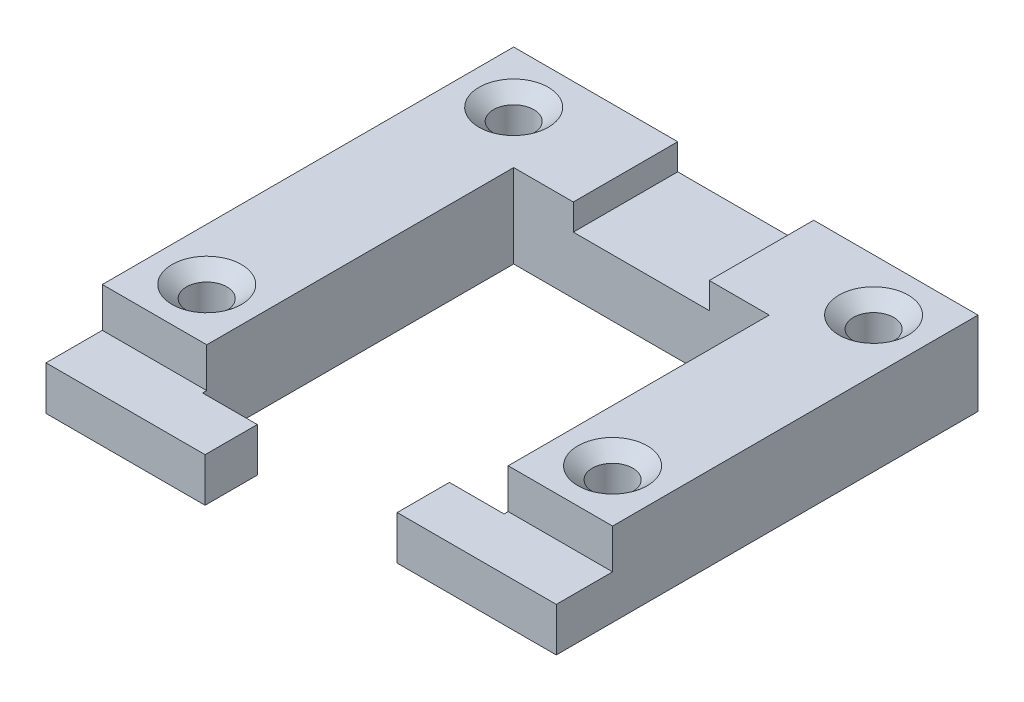
ISO-10303-21;
HEADER;
FILE_DESCRIPTION(('STEP AP214'),'2;1');
FILE_NAME('part.step','',(''),(''),'','','');
FILE_SCHEMA(('AUTOMOTIVE_DESIGN { 1 0 10303 214 1 1 1 1 }'));
ENDSEC;
DATA;
#1=APPLICATION_CONTEXT('core data for automotive mechanical design processes');
#2=APPLICATION_PROTOCOL_DEFINITION('international standard','automotive_design',2000,#1);
#3=PRODUCT_CONTEXT('',#1,'mechanical');
#4=PRODUCT('Part','Part','',(#3));
#5=PRODUCT_RELATED_PRODUCT_CATEGORY('part','',(#4));
#6=PRODUCT_DEFINITION_FORMATION('','',#4);
#7=PRODUCT_DEFINITION_CONTEXT('part definition',#1,'design');
#8=PRODUCT_DEFINITION('design','',#6,#7);
#9=PRODUCT_DEFINITION_SHAPE('','',#8);
#10=(LENGTH_UNIT() NAMED_UNIT(*) SI_UNIT(.MILLI.,.METRE.));
#11=(NAMED_UNIT(*) PLANE_ANGLE_UNIT() SI_UNIT($,.RADIAN.));
#12=(NAMED_UNIT(*) SI_UNIT($,.STERADIAN.) SOLID_ANGLE_UNIT());
#13=UNCERTAINTY_MEASURE_WITH_UNIT(LENGTH_MEASURE(1.E-05),#10,'distance_accuracy_value','');
#14=(GEOMETRIC_REPRESENTATION_CONTEXT(3) GLOBAL_UNCERTAINTY_ASSIGNED_CONTEXT((#13)) GLOBAL_UNIT_ASSIGNED_CONTEXT((#10,
#11,#12)) REPRESENTATION_CONTEXT('',''));
#15=CARTESIAN_POINT('',(0.,0.,0.));
#16=DIRECTION('',(0.,0.,1.));
#17=DIRECTION('',(1.,0.,0.));
#18=AXIS2_PLACEMENT_3D('',#15,#16,#17);
#19=CARTESIAN_POINT('',(28.2399999999999,29.21,-44.45));
#20=DIRECTION('',(0.,0.,1.));
#21=DIRECTION('',(1.,0.,0.));
#22=AXIS2_PLACEMENT_3D('',#19,#20,#21);
#23=PLANE('',#22);
#24=DIRECTION('',(0.,-1.,0.));
#25=VECTOR('',#24,1.);
#26=CARTESIAN_POINT('',(15.5399999999999,29.21,-44.45));
#27=LINE('',#26,#25);
#28=CARTESIAN_POINT('',(15.5399999999999,29.21,-44.45));
#29=VERTEX_POINT('',#28);
#30=CARTESIAN_POINT('',(15.5399999999999,24.384,-44.45));
#31=VERTEX_POINT('',#30);
#32=EDGE_CURVE('E191',#29,#31,#27,.T.);
#33=ORIENTED_EDGE('',*,*,#32,.T.);
#34=DIRECTION('',(-1.,0.,0.));
#35=VECTOR('',#34,1.);
#36=CARTESIAN_POINT('',(0.,24.384,-44.45));
#37=LINE('',#36,#35);
#38=CARTESIAN_POINT('',(28.2399999999999,24.384,-44.45));
#39=VERTEX_POINT('',#38);
#40=EDGE_CURVE('E178',#39,#31,#37,.T.);
#41=ORIENTED_EDGE('',*,*,#40,.F.);
#42=DIRECTION('',(0.,-1.,0.));
#43=VECTOR('',#42,1.);
#44=CARTESIAN_POINT('',(28.2399999999999,29.21,-44.45));
#45=LINE('',#44,#43);
#46=CARTESIAN_POINT('',(28.2399999999999,29.21,-44.45));
#47=VERTEX_POINT('',#46);
#48=EDGE_CURVE('E188',#47,#39,#45,.T.);
#49=ORIENTED_EDGE('',*,*,#48,.F.);
#50=DIRECTION('',(-1.,0.,0.));
#51=VECTOR('',#50,1.);
#52=CARTESIAN_POINT('',(28.2399999999999,29.21,-44.45));
#53=LINE('',#52,#51);
#54=EDGE_CURVE('E236',#47,#29,#53,.T.);
#55=ORIENTED_EDGE('',*,*,#54,.T.);
#56=EDGE_LOOP('',(#33,#41,#49,#55));
#57=FACE_BOUND('',#56,.T.);
#58=ADVANCED_FACE('F37',(#57),#23,.T.);
#59=CARTESIAN_POINT('',(28.2399999999999,29.21,-88.9));
#60=DIRECTION('',(0.,0.,1.));
#61=DIRECTION('',(1.,0.,0.));
#62=AXIS2_PLACEMENT_3D('',#59,#60,#61);
#63=PLANE('',#62);
#64=DIRECTION('',(0.,-1.,0.));
#65=VECTOR('',#64,1.);
#66=CARTESIAN_POINT('',(-8.28500000000023,0.,-88.9));
#67=LINE('',#66,#65);
#68=CARTESIAN_POINT('',(-8.28500000000023,29.21,-88.9));
#69=VERTEX_POINT('',#68);
#70=CARTESIAN_POINT('',(-8.28500000000023,26.035,-88.9));
#71=VERTEX_POINT('',#70);
#72=EDGE_CURVE('E216',#69,#71,#67,.T.);
#73=ORIENTED_EDGE('',*,*,#72,.T.);
#74=DIRECTION('',(-1.,0.,0.));
#75=VECTOR('',#74,1.);
#76=CARTESIAN_POINT('',(0.,26.035,-88.9));
#77=LINE('',#76,#75);
#78=CARTESIAN_POINT('',(8.25499999999979,26.035,-88.9));
#79=VERTEX_POINT('',#78);
#80=EDGE_CURVE('E321',#79,#71,#77,.T.);
#81=ORIENTED_EDGE('',*,*,#80,.F.);
#82=DIRECTION('',(0.,-1.,0.));
#83=VECTOR('',#82,1.);
#84=CARTESIAN_POINT('',(8.25499999999978,0.,-88.9));
#85=LINE('',#84,#83);
#86=CARTESIAN_POINT('',(8.25499999999979,29.21,-88.9));
#87=VERTEX_POINT('',#86);
#88=EDGE_CURVE('E318',#87,#79,#85,.T.);
#89=ORIENTED_EDGE('',*,*,#88,.F.);
#90=DIRECTION('',(-1.,0.,0.));
#91=VECTOR('',#90,1.);
#92=CARTESIAN_POINT('',(28.2399999999999,29.21,-88.9));
#93=LINE('',#92,#91);
#94=CARTESIAN_POINT('',(28.2399999999999,29.21,-88.9));
#95=VERTEX_POINT('',#94);
#96=EDGE_CURVE('E198',#95,#87,#93,.T.);
#97=ORIENTED_EDGE('',*,*,#96,.F.);
#98=DIRECTION('',(0.,-1.,0.));
#99=VECTOR('',#98,1.);
#100=CARTESIAN_POINT('',(28.2399999999999,29.21,-88.9));
#101=LINE('',#100,#99);
#102=CARTESIAN_POINT('',(28.2399999999999,19.05,-88.9));
#103=VERTEX_POINT('',#102);
#104=EDGE_CURVE('E208',#95,#103,#101,.T.);
#105=ORIENTED_EDGE('',*,*,#104,.T.);
#106=DIRECTION('',(-1.,0.,0.));
#107=VECTOR('',#106,1.);
#108=CARTESIAN_POINT('',(28.2399999999999,19.05,-88.9));
#109=LINE('',#108,#107);
#110=CARTESIAN_POINT('',(-28.2400000000001,19.05,-88.9));
#111=VERTEX_POINT('',#110);
#112=EDGE_CURVE('E261',#103,#111,#109,.T.);
#113=ORIENTED_EDGE('',*,*,#112,.T.);
#114=DIRECTION('',(0.,-1.,0.));
#115=VECTOR('',#114,1.);
#116=CARTESIAN_POINT('',(-28.2400000000001,29.21,-88.9));
#117=LINE('',#116,#115);
#118=CARTESIAN_POINT('',(-28.2400000000001,29.21,-88.9));
#119=VERTEX_POINT('',#118);
#120=EDGE_CURVE('E265',#119,#111,#117,.T.);
#121=ORIENTED_EDGE('',*,*,#120,.F.);
#122=EDGE_CURVE('E203',#69,#119,#93,.T.);
#123=ORIENTED_EDGE('',*,*,#122,.F.);
#124=EDGE_LOOP('',(#73,#81,#89,#97,#105,#113,#121,#123));
#125=FACE_BOUND('',#124,.T.);
#126=ADVANCED_FACE('F422',(#125),#63,.F.);
#127=CARTESIAN_POINT('',(15.5399999999999,29.21,-76.2));
#128=DIRECTION('',(0.,0.,1.));
#129=DIRECTION('',(1.,0.,0.));
#130=AXIS2_PLACEMENT_3D('',#127,#128,#129);
#131=PLANE('',#130);
#132=DIRECTION('',(1.,0.,0.));
#133=VECTOR('',#132,1.);
#134=CARTESIAN_POINT('',(15.5399999999999,26.035,-76.2));
#135=LINE('',#134,#133);
#136=CARTESIAN_POINT('',(-8.28500000000023,26.035,-76.2));
#137=VERTEX_POINT('',#136);
#138=CARTESIAN_POINT('',(8.25499999999979,26.035,-76.2));
#139=VERTEX_POINT('',#138);
#140=EDGE_CURVE('E11',#137,#139,#135,.T.);
#141=ORIENTED_EDGE('',*,*,#140,.F.);
#142=DIRECTION('',(0.,1.,0.));
#143=VECTOR('',#142,1.);
#144=CARTESIAN_POINT('',(-8.28500000000022,29.21,-76.2));
#145=LINE('',#144,#143);
#146=CARTESIAN_POINT('',(-8.28500000000023,29.21,-76.2));
#147=VERTEX_POINT('',#146);
#148=EDGE_CURVE('E213',#137,#147,#145,.T.);
#149=ORIENTED_EDGE('',*,*,#148,.T.);
#150=DIRECTION('',(-1.,0.,0.));
#151=VECTOR('',#150,1.);
#152=CARTESIAN_POINT('',(15.5399999999999,29.21,-76.2));
#153=LINE('',#152,#151);
#154=CARTESIAN_POINT('',(-15.5400000000001,29.21,-76.2));
#155=VERTEX_POINT('',#154);
#156=EDGE_CURVE('E223',#147,#155,#153,.T.);
#157=ORIENTED_EDGE('',*,*,#156,.T.);
#158=DIRECTION('',(0.,-1.,0.));
#159=VECTOR('',#158,1.);
#160=CARTESIAN_POINT('',(-15.5400000000001,29.21,-76.2));
#161=LINE('',#160,#159);
#162=CARTESIAN_POINT('',(-15.5400000000001,19.05,-76.2));
#163=VERTEX_POINT('',#162);
#164=EDGE_CURVE('E271',#155,#163,#161,.T.);
#165=ORIENTED_EDGE('',*,*,#164,.T.);
#166=DIRECTION('',(-1.,0.,0.));
#167=VECTOR('',#166,1.);
#168=CARTESIAN_POINT('',(15.5399999999999,19.05,-76.2));
#169=LINE('',#168,#167);
#170=CARTESIAN_POINT('',(15.5399999999999,19.05,-76.2));
#171=VERTEX_POINT('',#170);
#172=EDGE_CURVE('E252',#171,#163,#169,.T.);
#173=ORIENTED_EDGE('',*,*,#172,.F.);
#174=DIRECTION('',(0.,-1.,0.));
#175=VECTOR('',#174,1.);
#176=CARTESIAN_POINT('',(15.5399999999999,29.21,-76.2));
#177=LINE('',#176,#175);
#178=CARTESIAN_POINT('',(15.5399999999999,29.21,-76.2));
#179=VERTEX_POINT('',#178);
#180=EDGE_CURVE('E200',#179,#171,#177,.T.);
#181=ORIENTED_EDGE('',*,*,#180,.F.);
#182=CARTESIAN_POINT('',(8.25499999999979,29.21,-76.2));
#183=VERTEX_POINT('',#182);
#184=EDGE_CURVE('E232',#179,#183,#153,.T.);
#185=ORIENTED_EDGE('',*,*,#184,.T.);
#186=DIRECTION('',(0.,1.,0.));
#187=VECTOR('',#186,1.);
#188=CARTESIAN_POINT('',(8.25499999999979,29.21,-76.2));
#189=LINE('',#188,#187);
#190=EDGE_CURVE('E60',#139,#183,#189,.T.);
#191=ORIENTED_EDGE('',*,*,#190,.F.);
#192=EDGE_LOOP('',(#141,#149,#157,#165,#173,#181,#185,#191));
#193=FACE_BOUND('',#192,.T.);
#194=ADVANCED_FACE('F222',(#193),#131,.T.);
#195=CARTESIAN_POINT('',(0.,29.21,0.));
#196=DIRECTION('',(0.,-1.,0.));
#197=DIRECTION('',(0.,0.,-1.));
#198=AXIS2_PLACEMENT_3D('',#195,#196,#197);
#199=PLANE('',#198);
#200=CARTESIAN_POINT('',(-21.8900000000001,29.21,-82.55));
#201=DIRECTION('',(0.,1.,0.));
#202=DIRECTION('',(0.,0.,1.));
#203=AXIS2_PLACEMENT_3D('',#200,#201,#202);
#204=CIRCLE('',#203,4.2164);
#205=CARTESIAN_POINT('',(-21.8900000000001,29.21,-78.3336));
#206=VERTEX_POINT('',#205);
#207=EDGE_CURVE('E225',#206,#206,#204,.T.);
#208=ORIENTED_EDGE('',*,*,#207,.F.);
#209=EDGE_LOOP('',(#208));
#210=FACE_BOUND('',#209,.T.);
#211=CARTESIAN_POINT('',(-21.8900000000001,29.21,-45.212));
#212=DIRECTION('',(0.,1.,0.));
#213=DIRECTION('',(0.,0.,1.));
#214=AXIS2_PLACEMENT_3D('',#211,#212,#213);
#215=CIRCLE('',#214,4.2164);
#216=CARTESIAN_POINT('',(-21.8900000000001,29.21,-40.9956));
#217=VERTEX_POINT('',#216);
#218=EDGE_CURVE('E346',#217,#217,#215,.T.);
#219=ORIENTED_EDGE('',*,*,#218,.F.);
#220=EDGE_LOOP('',(#219));
#221=FACE_BOUND('',#220,.T.);
#222=DIRECTION('',(0.,0.,1.));
#223=VECTOR('',#222,1.);
#224=CARTESIAN_POINT('',(-8.28500000000023,29.21,0.));
#225=LINE('',#224,#223);
#226=EDGE_CURVE('E45',#69,#147,#225,.T.);
#227=ORIENTED_EDGE('',*,*,#226,.F.);
#228=ORIENTED_EDGE('',*,*,#122,.T.);
#229=DIRECTION('',(0.,0.,-1.));
#230=VECTOR('',#229,1.);
#231=CARTESIAN_POINT('',(-28.2400000000001,29.21,-38.862));
#232=LINE('',#231,#230);
#233=CARTESIAN_POINT('',(-28.2400000000001,29.21,-38.862));
#234=VERTEX_POINT('',#233);
#235=EDGE_CURVE('E244',#234,#119,#232,.T.);
#236=ORIENTED_EDGE('',*,*,#235,.F.);
#237=DIRECTION('',(-1.,0.,0.));
#238=VECTOR('',#237,1.);
#239=CARTESIAN_POINT('',(-15.5400000000001,29.21,-38.862));
#240=LINE('',#239,#238);
#241=CARTESIAN_POINT('',(-15.5400000000001,29.21,-38.862));
#242=VERTEX_POINT('',#241);
#243=EDGE_CURVE('E241',#242,#234,#240,.T.);
#244=ORIENTED_EDGE('',*,*,#243,.F.);
#245=DIRECTION('',(0.,0.,-1.));
#246=VECTOR('',#245,1.);
#247=CARTESIAN_POINT('',(-15.5400000000001,29.21,-38.862));
#248=LINE('',#247,#246);
#249=EDGE_CURVE('E230',#242,#155,#248,.T.);
#250=ORIENTED_EDGE('',*,*,#249,.T.);
#251=ORIENTED_EDGE('',*,*,#156,.F.);
#252=EDGE_LOOP('',(#227,#228,#236,#244,#250,#251));
#253=FACE_BOUND('',#252,.T.);
#254=ADVANCED_FACE('F227',(#210,#221,#253),#199,.F.);
#255=CARTESIAN_POINT('',(28.2399999999999,29.21,-88.9));
#256=DIRECTION('',(1.,0.,0.));
#257=DIRECTION('',(0.,0.,-1.));
#258=AXIS2_PLACEMENT_3D('',#255,#256,#257);
#259=PLANE('',#258);
#260=DIRECTION('',(0.,0.,1.));
#261=VECTOR('',#260,1.);
#262=CARTESIAN_POINT('',(28.2399999999999,19.05,-88.9));
#263=LINE('',#262,#261);
#264=CARTESIAN_POINT('',(28.2399999999999,19.05,-37.6));
#265=VERTEX_POINT('',#264);
#266=EDGE_CURVE('E247',#103,#265,#263,.T.);
#267=ORIENTED_EDGE('',*,*,#266,.F.);
#268=ORIENTED_EDGE('',*,*,#104,.F.);
#269=DIRECTION('',(0.,0.,1.));
#270=VECTOR('',#269,1.);
#271=CARTESIAN_POINT('',(28.2399999999999,29.21,-88.9));
#272=LINE('',#271,#270);
#273=EDGE_CURVE('E197',#95,#47,#272,.T.);
#274=ORIENTED_EDGE('',*,*,#273,.T.);
#275=ORIENTED_EDGE('',*,*,#48,.T.);
#276=DIRECTION('',(0.,0.,1.));
#277=VECTOR('',#276,1.);
#278=CARTESIAN_POINT('',(28.2399999999999,24.384,0.));
#279=LINE('',#278,#277);
#280=CARTESIAN_POINT('',(28.2399999999999,24.384,-37.6));
#281=VERTEX_POINT('',#280);
#282=EDGE_CURVE('E175',#39,#281,#279,.T.);
#283=ORIENTED_EDGE('',*,*,#282,.T.);
#284=DIRECTION('',(0.,-1.,0.));
#285=VECTOR('',#284,1.);
#286=CARTESIAN_POINT('',(28.2399999999999,24.384,-37.6));
#287=LINE('',#286,#285);
#288=EDGE_CURVE('E367',#281,#265,#287,.T.);
#289=ORIENTED_EDGE('',*,*,#288,.T.);
#290=EDGE_LOOP('',(#267,#268,#274,#275,#283,#289));
#291=FACE_BOUND('',#290,.T.);
#292=ADVANCED_FACE('F39',(#291),#259,.T.);
#293=CARTESIAN_POINT('',(-28.2400000000001,29.21,-38.862));
#294=DIRECTION('',(-1.,0.,0.));
#295=DIRECTION('',(0.,0.,1.));
#296=AXIS2_PLACEMENT_3D('',#293,#294,#295);
#297=PLANE('',#296);
#298=DIRECTION('',(0.,0.,-1.));
#299=VECTOR('',#298,1.);
#300=CARTESIAN_POINT('',(-28.2400000000001,19.05,-38.862));
#301=LINE('',#300,#299);
#302=CARTESIAN_POINT('',(-28.2400000000001,19.05,-32.012));
#303=VERTEX_POINT('',#302);
#304=EDGE_CURVE('E258',#303,#111,#301,.T.);
#305=ORIENTED_EDGE('',*,*,#304,.F.);
#306=DIRECTION('',(0.,-1.,0.));
#307=VECTOR('',#306,1.);
#308=CARTESIAN_POINT('',(-28.2400000000001,24.384,-32.012));
#309=LINE('',#308,#307);
#310=CARTESIAN_POINT('',(-28.2400000000001,24.384,-32.012));
#311=VERTEX_POINT('',#310);
#312=EDGE_CURVE('E309',#311,#303,#309,.T.);
#313=ORIENTED_EDGE('',*,*,#312,.F.);
#314=DIRECTION('',(0.,0.,1.));
#315=VECTOR('',#314,1.);
#316=CARTESIAN_POINT('',(-28.2400000000001,24.384,0.));
#317=LINE('',#316,#315);
#318=CARTESIAN_POINT('',(-28.2400000000001,24.384,-38.862));
#319=VERTEX_POINT('',#318);
#320=EDGE_CURVE('E304',#319,#311,#317,.T.);
#321=ORIENTED_EDGE('',*,*,#320,.F.);
#322=DIRECTION('',(0.,-1.,0.));
#323=VECTOR('',#322,1.);
#324=CARTESIAN_POINT('',(-28.2400000000001,29.21,-38.862));
#325=LINE('',#324,#323);
#326=EDGE_CURVE('E267',#234,#319,#325,.T.);
#327=ORIENTED_EDGE('',*,*,#326,.F.);
#328=ORIENTED_EDGE('',*,*,#235,.T.);
#329=ORIENTED_EDGE('',*,*,#120,.T.);
#330=EDGE_LOOP('',(#305,#313,#321,#327,#328,#329));
#331=FACE_BOUND('',#330,.T.);
#332=ADVANCED_FACE('F404',(#331),#297,.T.);
#333=CARTESIAN_POINT('',(-15.5400000000001,29.21,-38.862));
#334=DIRECTION('',(0.,0.,1.));
#335=DIRECTION('',(1.,0.,0.));
#336=AXIS2_PLACEMENT_3D('',#333,#334,#335);
#337=PLANE('',#336);
#338=DIRECTION('',(-1.,0.,0.));
#339=VECTOR('',#338,1.);
#340=CARTESIAN_POINT('',(0.,24.384,-38.862));
#341=LINE('',#340,#339);
#342=CARTESIAN_POINT('',(-15.5400000000001,24.384,-38.862));
#343=VERTEX_POINT('',#342);
#344=EDGE_CURVE('E52',#343,#319,#341,.T.);
#345=ORIENTED_EDGE('',*,*,#344,.F.);
#346=DIRECTION('',(0.,-1.,0.));
#347=VECTOR('',#346,1.);
#348=CARTESIAN_POINT('',(-15.5400000000001,29.21,-38.862));
#349=LINE('',#348,#347);
#350=EDGE_CURVE('E269',#242,#343,#349,.T.);
#351=ORIENTED_EDGE('',*,*,#350,.F.);
#352=ORIENTED_EDGE('',*,*,#243,.T.);
#353=ORIENTED_EDGE('',*,*,#326,.T.);
#354=EDGE_LOOP('',(#345,#351,#352,#353));
#355=FACE_BOUND('',#354,.T.);
#356=ADVANCED_FACE('F435',(#355),#337,.T.);
#357=CARTESIAN_POINT('',(-15.5400000000001,29.21,-38.862));
#358=DIRECTION('',(-1.,0.,0.));
#359=DIRECTION('',(0.,0.,1.));
#360=AXIS2_PLACEMENT_3D('',#357,#358,#359);
#361=PLANE('',#360);
#362=DIRECTION('',(0.,0.,-1.));
#363=VECTOR('',#362,1.);
#364=CARTESIAN_POINT('',(-15.5400000000001,19.05,-38.862));
#365=LINE('',#364,#363);
#366=CARTESIAN_POINT('',(-15.5400000000001,19.05,-38.362));
#367=VERTEX_POINT('',#366);
#368=EDGE_CURVE('E255',#367,#163,#365,.T.);
#369=ORIENTED_EDGE('',*,*,#368,.T.);
#370=ORIENTED_EDGE('',*,*,#164,.F.);
#371=ORIENTED_EDGE('',*,*,#249,.F.);
#372=ORIENTED_EDGE('',*,*,#350,.T.);
#373=DIRECTION('',(0.,0.,1.));
#374=VECTOR('',#373,1.);
#375=CARTESIAN_POINT('',(-15.5400000000001,24.384,0.));
#376=LINE('',#375,#374);
#377=CARTESIAN_POINT('',(-15.5400000000001,24.384,-38.362));
#378=VERTEX_POINT('',#377);
#379=EDGE_CURVE('E387',#343,#378,#376,.T.);
#380=ORIENTED_EDGE('',*,*,#379,.T.);
#381=DIRECTION('',(0.,-1.,0.));
#382=VECTOR('',#381,1.);
#383=CARTESIAN_POINT('',(-15.5400000000001,24.384,-38.362));
#384=LINE('',#383,#382);
#385=EDGE_CURVE('E288',#378,#367,#384,.T.);
#386=ORIENTED_EDGE('',*,*,#385,.T.);
#387=EDGE_LOOP('',(#369,#370,#371,#372,#380,#386));
#388=FACE_BOUND('',#387,.T.);
#389=ADVANCED_FACE('F286',(#388),#361,.F.);
#390=CARTESIAN_POINT('',(15.5399999999999,29.21,-76.2));
#391=DIRECTION('',(1.,0.,0.));
#392=DIRECTION('',(0.,0.,-1.));
#393=AXIS2_PLACEMENT_3D('',#390,#391,#392);
#394=PLANE('',#393);
#395=DIRECTION('',(0.,0.,1.));
#396=VECTOR('',#395,1.);
#397=CARTESIAN_POINT('',(15.5399999999999,19.05,-76.2));
#398=LINE('',#397,#396);
#399=CARTESIAN_POINT('',(15.5399999999999,19.05,-43.95));
#400=VERTEX_POINT('',#399);
#401=EDGE_CURVE('E249',#171,#400,#398,.T.);
#402=ORIENTED_EDGE('',*,*,#401,.T.);
#403=DIRECTION('',(0.,-1.,0.));
#404=VECTOR('',#403,1.);
#405=CARTESIAN_POINT('',(15.5399999999999,24.384,-43.95));
#406=LINE('',#405,#404);
#407=CARTESIAN_POINT('',(15.5399999999999,24.384,-43.95));
#408=VERTEX_POINT('',#407);
#409=EDGE_CURVE('E297',#408,#400,#406,.T.);
#410=ORIENTED_EDGE('',*,*,#409,.F.);
#411=DIRECTION('',(0.,0.,1.));
#412=VECTOR('',#411,1.);
#413=CARTESIAN_POINT('',(15.5399999999999,24.384,0.));
#414=LINE('',#413,#412);
#415=EDGE_CURVE('E365',#31,#408,#414,.T.);
#416=ORIENTED_EDGE('',*,*,#415,.F.);
#417=ORIENTED_EDGE('',*,*,#32,.F.);
#418=DIRECTION('',(0.,0.,1.));
#419=VECTOR('',#418,1.);
#420=CARTESIAN_POINT('',(15.5399999999999,29.21,-76.2));
#421=LINE('',#420,#419);
#422=EDGE_CURVE('E233',#179,#29,#421,.T.);
#423=ORIENTED_EDGE('',*,*,#422,.F.);
#424=ORIENTED_EDGE('',*,*,#180,.T.);
#425=EDGE_LOOP('',(#402,#410,#416,#417,#423,#424));
#426=FACE_BOUND('',#425,.T.);
#427=ADVANCED_FACE('F275',(#426),#394,.F.);
#428=CARTESIAN_POINT('',(21.8899999999999,29.21,-82.55));
#429=DIRECTION('',(0.,1.,0.));
#430=DIRECTION('',(0.,0.,1.));
#431=AXIS2_PLACEMENT_3D('',#428,#429,#430);
#432=CIRCLE('',#431,4.2164);
#433=CARTESIAN_POINT('',(21.8899999999999,29.21,-78.3336));
#434=VERTEX_POINT('',#433);
#435=EDGE_CURVE('E337',#434,#434,#432,.T.);
#436=ORIENTED_EDGE('',*,*,#435,.F.);
#437=EDGE_LOOP('',(#436));
#438=FACE_BOUND('',#437,.T.);
#439=CARTESIAN_POINT('',(21.8899999999999,29.21,-50.8));
#440=DIRECTION('',(0.,1.,0.));
#441=DIRECTION('',(0.,0.,1.));
#442=AXIS2_PLACEMENT_3D('',#439,#440,#441);
#443=CIRCLE('',#442,4.2164);
#444=CARTESIAN_POINT('',(21.8899999999999,29.21,-46.5836));
#445=VERTEX_POINT('',#444);
#446=EDGE_CURVE('E355',#445,#445,#443,.T.);
#447=ORIENTED_EDGE('',*,*,#446,.F.);
#448=EDGE_LOOP('',(#447));
#449=FACE_BOUND('',#448,.T.);
#450=ORIENTED_EDGE('',*,*,#96,.T.);
#451=DIRECTION('',(0.,0.,1.));
#452=VECTOR('',#451,1.);
#453=CARTESIAN_POINT('',(8.25499999999979,29.21,0.));
#454=LINE('',#453,#452);
#455=EDGE_CURVE('E207',#87,#183,#454,.T.);
#456=ORIENTED_EDGE('',*,*,#455,.T.);
#457=ORIENTED_EDGE('',*,*,#184,.F.);
#458=ORIENTED_EDGE('',*,*,#422,.T.);
#459=ORIENTED_EDGE('',*,*,#54,.F.);
#460=ORIENTED_EDGE('',*,*,#273,.F.);
#461=EDGE_LOOP('',(#450,#456,#457,#458,#459,#460));
#462=FACE_BOUND('',#461,.T.);
#463=ADVANCED_FACE('F364',(#438,#449,#462),#199,.F.);
#464=CARTESIAN_POINT('',(0.,19.05,0.));
#465=DIRECTION('',(0.,-1.,0.));
#466=DIRECTION('',(0.,0.,-1.));
#467=AXIS2_PLACEMENT_3D('',#464,#465,#466);
#468=PLANE('',#467);
#469=CARTESIAN_POINT('',(-21.8900000000001,19.05,-82.55));
#470=DIRECTION('',(0.,1.,0.));
#471=DIRECTION('',(0.,0.,1.));
#472=AXIS2_PLACEMENT_3D('',#469,#470,#471);
#473=CIRCLE('',#472,2.45745);
#474=CARTESIAN_POINT('',(-21.8900000000001,19.05,-80.09255));
#475=VERTEX_POINT('',#474);
#476=EDGE_CURVE('E334',#475,#475,#473,.T.);
#477=ORIENTED_EDGE('',*,*,#476,.T.);
#478=EDGE_LOOP('',(#477));
#479=FACE_BOUND('',#478,.T.);
#480=CARTESIAN_POINT('',(21.8899999999999,19.05,-82.55));
#481=DIRECTION('',(0.,1.,0.));
#482=DIRECTION('',(0.,0.,1.));
#483=AXIS2_PLACEMENT_3D('',#480,#481,#482);
#484=CIRCLE('',#483,2.45745);
#485=CARTESIAN_POINT('',(21.8899999999999,19.05,-80.09255));
#486=VERTEX_POINT('',#485);
#487=EDGE_CURVE('E343',#486,#486,#484,.T.);
#488=ORIENTED_EDGE('',*,*,#487,.T.);
#489=EDGE_LOOP('',(#488));
#490=FACE_BOUND('',#489,.T.);
#491=CARTESIAN_POINT('',(-21.8900000000001,19.05,-45.212));
#492=DIRECTION('',(0.,1.,0.));
#493=DIRECTION('',(0.,0.,1.));
#494=AXIS2_PLACEMENT_3D('',#491,#492,#493);
#495=CIRCLE('',#494,2.45745);
#496=CARTESIAN_POINT('',(-21.8900000000001,19.05,-42.75455));
#497=VERTEX_POINT('',#496);
#498=EDGE_CURVE('E352',#497,#497,#495,.T.);
#499=ORIENTED_EDGE('',*,*,#498,.T.);
#500=EDGE_LOOP('',(#499));
#501=FACE_BOUND('',#500,.T.);
#502=CARTESIAN_POINT('',(21.8899999999999,19.05,-50.8));
#503=DIRECTION('',(0.,1.,0.));
#504=DIRECTION('',(0.,0.,1.));
#505=AXIS2_PLACEMENT_3D('',#502,#503,#504);
#506=CIRCLE('',#505,2.45745);
#507=CARTESIAN_POINT('',(21.8899999999999,19.05,-48.34255));
#508=VERTEX_POINT('',#507);
#509=EDGE_CURVE('E250',#508,#508,#506,.T.);
#510=ORIENTED_EDGE('',*,*,#509,.T.);
#511=EDGE_LOOP('',(#510));
#512=FACE_BOUND('',#511,.T.);
#513=ORIENTED_EDGE('',*,*,#266,.T.);
#514=DIRECTION('',(-1.,0.,0.));
#515=VECTOR('',#514,1.);
#516=CARTESIAN_POINT('',(0.,19.05,-37.6));
#517=LINE('',#516,#515);
#518=CARTESIAN_POINT('',(8.88999999999985,19.05,-37.6));
#519=VERTEX_POINT('',#518);
#520=EDGE_CURVE('E376',#265,#519,#517,.T.);
#521=ORIENTED_EDGE('',*,*,#520,.T.);
#522=DIRECTION('',(0.,0.,1.));
#523=VECTOR('',#522,1.);
#524=CARTESIAN_POINT('',(8.88999999999985,19.05,0.));
#525=LINE('',#524,#523);
#526=CARTESIAN_POINT('',(8.88999999999985,19.05,-43.95));
#527=VERTEX_POINT('',#526);
#528=EDGE_CURVE('E379',#527,#519,#525,.T.);
#529=ORIENTED_EDGE('',*,*,#528,.F.);
#530=DIRECTION('',(-1.,0.,0.));
#531=VECTOR('',#530,1.);
#532=CARTESIAN_POINT('',(0.,19.05,-43.95));
#533=LINE('',#532,#531);
#534=EDGE_CURVE('E192',#400,#527,#533,.T.);
#535=ORIENTED_EDGE('',*,*,#534,.F.);
#536=ORIENTED_EDGE('',*,*,#401,.F.);
#537=ORIENTED_EDGE('',*,*,#172,.T.);
#538=ORIENTED_EDGE('',*,*,#368,.F.);
#539=DIRECTION('',(1.,0.,0.));
#540=VECTOR('',#539,1.);
#541=CARTESIAN_POINT('',(0.,19.05,-38.362));
#542=LINE('',#541,#540);
#543=CARTESIAN_POINT('',(-8.89000000000014,19.05,-38.362));
#544=VERTEX_POINT('',#543);
#545=EDGE_CURVE('E292',#367,#544,#542,.T.);
#546=ORIENTED_EDGE('',*,*,#545,.T.);
#547=DIRECTION('',(0.,0.,1.));
#548=VECTOR('',#547,1.);
#549=CARTESIAN_POINT('',(-8.89000000000014,19.05,0.));
#550=LINE('',#549,#548);
#551=CARTESIAN_POINT('',(-8.89000000000014,19.05,-32.012));
#552=VERTEX_POINT('',#551);
#553=EDGE_CURVE('E295',#544,#552,#550,.T.);
#554=ORIENTED_EDGE('',*,*,#553,.T.);
#555=DIRECTION('',(1.,0.,0.));
#556=VECTOR('',#555,1.);
#557=CARTESIAN_POINT('',(0.,19.05,-32.012));
#558=LINE('',#557,#556);
#559=EDGE_CURVE('E299',#303,#552,#558,.T.);
#560=ORIENTED_EDGE('',*,*,#559,.F.);
#561=ORIENTED_EDGE('',*,*,#304,.T.);
#562=ORIENTED_EDGE('',*,*,#112,.F.);
#563=EDGE_LOOP('',(#513,#521,#529,#535,#536,#537,#538,#546,#554,#560,#561,#562));
#564=FACE_BOUND('',#563,.T.);
#565=ADVANCED_FACE('F282',(#479,#490,#501,#512,#564),#468,.T.);
#566=CARTESIAN_POINT('',(21.8899999999999,29.21,-50.8));
#567=DIRECTION('',(0.,1.,0.));
#568=DIRECTION('',(0.,0.,1.));
#569=AXIS2_PLACEMENT_3D('',#566,#567,#568);
#570=CYLINDRICAL_SURFACE('',#569,2.45744999999999);
#571=ORIENTED_EDGE('',*,*,#509,.F.);
#572=EDGE_LOOP('',(#571));
#573=FACE_BOUND('',#572,.T.);
#574=CARTESIAN_POINT('',(21.8899999999999,27.7340657037407,-50.8));
#575=DIRECTION('',(0.,1.,0.));
#576=DIRECTION('',(0.,0.,1.));
#577=AXIS2_PLACEMENT_3D('',#574,#575,#576);
#578=CIRCLE('',#577,2.45744999999999);
#579=CARTESIAN_POINT('',(21.8899999999999,27.7340657037407,-48.34255));
#580=VERTEX_POINT('',#579);
#581=EDGE_CURVE('E358',#580,#580,#578,.T.);
#582=ORIENTED_EDGE('',*,*,#581,.T.);
#583=EDGE_LOOP('',(#582));
#584=FACE_BOUND('',#583,.T.);
#585=ADVANCED_FACE('F442',(#573,#584),#570,.F.);
#586=CARTESIAN_POINT('',(21.8899999999999,29.21,-50.8));
#587=DIRECTION('',(0.,1.,0.));
#588=DIRECTION('',(0.,0.,1.));
#589=AXIS2_PLACEMENT_3D('',#586,#587,#588);
#590=CONICAL_SURFACE('',#589,4.2164,0.872664625997163);
#591=ORIENTED_EDGE('',*,*,#581,.F.);
#592=EDGE_LOOP('',(#591));
#593=FACE_BOUND('',#592,.T.);
#594=ORIENTED_EDGE('',*,*,#446,.T.);
#595=EDGE_LOOP('',(#594));
#596=FACE_BOUND('',#595,.T.);
#597=ADVANCED_FACE('F449',(#593,#596),#590,.F.);
#598=CARTESIAN_POINT('',(-21.8900000000001,29.21,-45.212));
#599=DIRECTION('',(0.,1.,0.));
#600=DIRECTION('',(0.,0.,1.));
#601=AXIS2_PLACEMENT_3D('',#598,#599,#600);
#602=CYLINDRICAL_SURFACE('',#601,2.45744999999999);
#603=ORIENTED_EDGE('',*,*,#498,.F.);
#604=EDGE_LOOP('',(#603));
#605=FACE_BOUND('',#604,.T.);
#606=CARTESIAN_POINT('',(-21.8900000000001,27.7340657037407,-45.212));
#607=DIRECTION('',(0.,1.,0.));
#608=DIRECTION('',(0.,0.,1.));
#609=AXIS2_PLACEMENT_3D('',#606,#607,#608);
#610=CIRCLE('',#609,2.45744999999999);
#611=CARTESIAN_POINT('',(-21.8900000000001,27.7340657037407,-42.75455));
#612=VERTEX_POINT('',#611);
#613=EDGE_CURVE('E349',#612,#612,#610,.T.);
#614=ORIENTED_EDGE('',*,*,#613,.T.);
#615=EDGE_LOOP('',(#614));
#616=FACE_BOUND('',#615,.T.);
#617=ADVANCED_FACE('F453',(#605,#616),#602,.F.);
#618=CARTESIAN_POINT('',(-21.8900000000001,29.21,-45.212));
#619=DIRECTION('',(0.,1.,0.));
#620=DIRECTION('',(0.,0.,1.));
#621=AXIS2_PLACEMENT_3D('',#618,#619,#620);
#622=CONICAL_SURFACE('',#621,4.2164,0.872664625997163);
#623=ORIENTED_EDGE('',*,*,#613,.F.);
#624=EDGE_LOOP('',(#623));
#625=FACE_BOUND('',#624,.T.);
#626=ORIENTED_EDGE('',*,*,#218,.T.);
#627=EDGE_LOOP('',(#626));
#628=FACE_BOUND('',#627,.T.);
#629=ADVANCED_FACE('F457',(#625,#628),#622,.F.);
#630=CARTESIAN_POINT('',(21.8899999999999,29.21,-82.55));
#631=DIRECTION('',(0.,1.,0.));
#632=DIRECTION('',(0.,0.,1.));
#633=AXIS2_PLACEMENT_3D('',#630,#631,#632);
#634=CYLINDRICAL_SURFACE('',#633,2.45744999999999);
#635=ORIENTED_EDGE('',*,*,#487,.F.);
#636=EDGE_LOOP('',(#635));
#637=FACE_BOUND('',#636,.T.);
#638=CARTESIAN_POINT('',(21.8899999999999,27.7340657037407,-82.55));
#639=DIRECTION('',(0.,1.,0.));
#640=DIRECTION('',(0.,0.,1.));
#641=AXIS2_PLACEMENT_3D('',#638,#639,#640);
#642=CIRCLE('',#641,2.45744999999999);
#643=CARTESIAN_POINT('',(21.8899999999999,27.7340657037407,-80.09255));
#644=VERTEX_POINT('',#643);
#645=EDGE_CURVE('E340',#644,#644,#642,.T.);
#646=ORIENTED_EDGE('',*,*,#645,.T.);
#647=EDGE_LOOP('',(#646));
#648=FACE_BOUND('',#647,.T.);
#649=ADVANCED_FACE('F461',(#637,#648),#634,.F.);
#650=CARTESIAN_POINT('',(21.8899999999999,29.21,-82.55));
#651=DIRECTION('',(0.,1.,0.));
#652=DIRECTION('',(0.,0.,1.));
#653=AXIS2_PLACEMENT_3D('',#650,#651,#652);
#654=CONICAL_SURFACE('',#653,4.2164,0.872664625997163);
#655=ORIENTED_EDGE('',*,*,#645,.F.);
#656=EDGE_LOOP('',(#655));
#657=FACE_BOUND('',#656,.T.);
#658=ORIENTED_EDGE('',*,*,#435,.T.);
#659=EDGE_LOOP('',(#658));
#660=FACE_BOUND('',#659,.T.);
#661=ADVANCED_FACE('F465',(#657,#660),#654,.F.);
#662=CARTESIAN_POINT('',(-21.8900000000001,29.21,-82.55));
#663=DIRECTION('',(0.,1.,0.));
#664=DIRECTION('',(0.,0.,1.));
#665=AXIS2_PLACEMENT_3D('',#662,#663,#664);
#666=CYLINDRICAL_SURFACE('',#665,2.45744999999999);
#667=ORIENTED_EDGE('',*,*,#476,.F.);
#668=EDGE_LOOP('',(#667));
#669=FACE_BOUND('',#668,.T.);
#670=CARTESIAN_POINT('',(-21.8900000000001,27.7340657037407,-82.55));
#671=DIRECTION('',(0.,1.,0.));
#672=DIRECTION('',(0.,0.,1.));
#673=AXIS2_PLACEMENT_3D('',#670,#671,#672);
#674=CIRCLE('',#673,2.45744999999999);
#675=CARTESIAN_POINT('',(-21.8900000000001,27.7340657037407,-80.09255));
#676=VERTEX_POINT('',#675);
#677=EDGE_CURVE('E331',#676,#676,#674,.T.);
#678=ORIENTED_EDGE('',*,*,#677,.T.);
#679=EDGE_LOOP('',(#678));
#680=FACE_BOUND('',#679,.T.);
#681=ADVANCED_FACE('F469',(#669,#680),#666,.F.);
#682=CARTESIAN_POINT('',(-21.8900000000001,29.21,-82.55));
#683=DIRECTION('',(0.,1.,0.));
#684=DIRECTION('',(0.,0.,1.));
#685=AXIS2_PLACEMENT_3D('',#682,#683,#684);
#686=CONICAL_SURFACE('',#685,4.2164,0.872664625997162);
#687=ORIENTED_EDGE('',*,*,#677,.F.);
#688=EDGE_LOOP('',(#687));
#689=FACE_BOUND('',#688,.T.);
#690=ORIENTED_EDGE('',*,*,#207,.T.);
#691=EDGE_LOOP('',(#690));
#692=FACE_BOUND('',#691,.T.);
#693=ADVANCED_FACE('F473',(#689,#692),#686,.F.);
#694=CARTESIAN_POINT('',(-8.28500000000023,0.,-38.862));
#695=DIRECTION('',(1.,0.,0.));
#696=DIRECTION('',(0.,1.,0.));
#697=AXIS2_PLACEMENT_3D('',#694,#695,#696);
#698=PLANE('',#697);
#699=DIRECTION('',(0.,0.,-1.));
#700=VECTOR('',#699,1.);
#701=CARTESIAN_POINT('',(-8.28500000000023,26.035,-38.862));
#702=LINE('',#701,#700);
#703=EDGE_CURVE('E325',#137,#71,#702,.T.);
#704=ORIENTED_EDGE('',*,*,#703,.T.);
#705=ORIENTED_EDGE('',*,*,#72,.F.);
#706=ORIENTED_EDGE('',*,*,#226,.T.);
#707=ORIENTED_EDGE('',*,*,#148,.F.);
#708=EDGE_LOOP('',(#704,#705,#706,#707));
#709=FACE_BOUND('',#708,.T.);
#710=ADVANCED_FACE('F212',(#709),#698,.T.);
#711=CARTESIAN_POINT('',(0.,26.035,-38.862));
#712=DIRECTION('',(0.,-1.,0.));
#713=DIRECTION('',(0.,0.,-1.));
#714=AXIS2_PLACEMENT_3D('',#711,#712,#713);
#715=PLANE('',#714);
#716=ORIENTED_EDGE('',*,*,#140,.T.);
#717=DIRECTION('',(0.,0.,-1.));
#718=VECTOR('',#717,1.);
#719=CARTESIAN_POINT('',(8.25499999999979,26.035,-38.862));
#720=LINE('',#719,#718);
#721=EDGE_CURVE('E324',#139,#79,#720,.T.);
#722=ORIENTED_EDGE('',*,*,#721,.T.);
#723=ORIENTED_EDGE('',*,*,#80,.T.);
#724=ORIENTED_EDGE('',*,*,#703,.F.);
#725=EDGE_LOOP('',(#716,#722,#723,#724));
#726=FACE_BOUND('',#725,.T.);
#727=ADVANCED_FACE('F480',(#726),#715,.F.);
#728=CARTESIAN_POINT('',(8.25499999999978,0.,-38.862));
#729=DIRECTION('',(1.,0.,0.));
#730=DIRECTION('',(0.,1.,0.));
#731=AXIS2_PLACEMENT_3D('',#728,#729,#730);
#732=PLANE('',#731);
#733=ORIENTED_EDGE('',*,*,#190,.T.);
#734=ORIENTED_EDGE('',*,*,#455,.F.);
#735=ORIENTED_EDGE('',*,*,#88,.T.);
#736=ORIENTED_EDGE('',*,*,#721,.F.);
#737=EDGE_LOOP('',(#733,#734,#735,#736));
#738=FACE_BOUND('',#737,.T.);
#739=ADVANCED_FACE('F481',(#738),#732,.F.);
#740=CARTESIAN_POINT('',(0.,24.384,-32.012));
#741=DIRECTION('',(0.,0.,-1.));
#742=DIRECTION('',(-1.,0.,0.));
#743=AXIS2_PLACEMENT_3D('',#740,#741,#742);
#744=PLANE('',#743);
#745=ORIENTED_EDGE('',*,*,#559,.T.);
#746=DIRECTION('',(0.,-1.,0.));
#747=VECTOR('',#746,1.);
#748=CARTESIAN_POINT('',(-8.89000000000014,24.384,-32.012));
#749=LINE('',#748,#747);
#750=CARTESIAN_POINT('',(-8.89000000000014,24.384,-32.012));
#751=VERTEX_POINT('',#750);
#752=EDGE_CURVE('E312',#751,#552,#749,.T.);
#753=ORIENTED_EDGE('',*,*,#752,.F.);
#754=DIRECTION('',(1.,0.,0.));
#755=VECTOR('',#754,1.);
#756=CARTESIAN_POINT('',(0.,24.384,-32.012));
#757=LINE('',#756,#755);
#758=EDGE_CURVE('E394',#311,#751,#757,.T.);
#759=ORIENTED_EDGE('',*,*,#758,.F.);
#760=ORIENTED_EDGE('',*,*,#312,.T.);
#761=EDGE_LOOP('',(#745,#753,#759,#760));
#762=FACE_BOUND('',#761,.T.);
#763=ADVANCED_FACE('F406',(#762),#744,.F.);
#764=CARTESIAN_POINT('',(-8.89000000000014,24.384,0.));
#765=DIRECTION('',(1.,0.,0.));
#766=DIRECTION('',(0.,0.,-1.));
#767=AXIS2_PLACEMENT_3D('',#764,#765,#766);
#768=PLANE('',#767);
#769=ORIENTED_EDGE('',*,*,#553,.F.);
#770=DIRECTION('',(0.,-1.,0.));
#771=VECTOR('',#770,1.);
#772=CARTESIAN_POINT('',(-8.89000000000014,24.384,-38.362));
#773=LINE('',#772,#771);
#774=CARTESIAN_POINT('',(-8.89000000000014,24.384,-38.362));
#775=VERTEX_POINT('',#774);
#776=EDGE_CURVE('E314',#775,#544,#773,.T.);
#777=ORIENTED_EDGE('',*,*,#776,.F.);
#778=DIRECTION('',(0.,0.,1.));
#779=VECTOR('',#778,1.);
#780=CARTESIAN_POINT('',(-8.89000000000014,24.384,0.));
#781=LINE('',#780,#779);
#782=EDGE_CURVE('E392',#775,#751,#781,.T.);
#783=ORIENTED_EDGE('',*,*,#782,.T.);
#784=ORIENTED_EDGE('',*,*,#752,.T.);
#785=EDGE_LOOP('',(#769,#777,#783,#784));
#786=FACE_BOUND('',#785,.T.);
#787=ADVANCED_FACE('F408',(#786),#768,.T.);
#788=CARTESIAN_POINT('',(0.,24.384,-38.362));
#789=DIRECTION('',(0.,0.,-1.));
#790=DIRECTION('',(-1.,0.,0.));
#791=AXIS2_PLACEMENT_3D('',#788,#789,#790);
#792=PLANE('',#791);
#793=ORIENTED_EDGE('',*,*,#545,.F.);
#794=ORIENTED_EDGE('',*,*,#385,.F.);
#795=DIRECTION('',(1.,0.,0.));
#796=VECTOR('',#795,1.);
#797=CARTESIAN_POINT('',(0.,24.384,-38.362));
#798=LINE('',#797,#796);
#799=EDGE_CURVE('E389',#378,#775,#798,.T.);
#800=ORIENTED_EDGE('',*,*,#799,.T.);
#801=ORIENTED_EDGE('',*,*,#776,.T.);
#802=EDGE_LOOP('',(#793,#794,#800,#801));
#803=FACE_BOUND('',#802,.T.);
#804=ADVANCED_FACE('F410',(#803),#792,.T.);
#805=CARTESIAN_POINT('',(0.,24.384,0.));
#806=DIRECTION('',(0.,-1.,0.));
#807=DIRECTION('',(0.,0.,-1.));
#808=AXIS2_PLACEMENT_3D('',#805,#806,#807);
#809=PLANE('',#808);
#810=ORIENTED_EDGE('',*,*,#344,.T.);
#811=ORIENTED_EDGE('',*,*,#320,.T.);
#812=ORIENTED_EDGE('',*,*,#758,.T.);
#813=ORIENTED_EDGE('',*,*,#782,.F.);
#814=ORIENTED_EDGE('',*,*,#799,.F.);
#815=ORIENTED_EDGE('',*,*,#379,.F.);
#816=EDGE_LOOP('',(#810,#811,#812,#813,#814,#815));
#817=FACE_BOUND('',#816,.T.);
#818=ADVANCED_FACE('F401',(#817),#809,.F.);
#819=CARTESIAN_POINT('',(0.,24.384,-43.95));
#820=DIRECTION('',(0.,0.,1.));
#821=DIRECTION('',(1.,0.,0.));
#822=AXIS2_PLACEMENT_3D('',#819,#820,#821);
#823=PLANE('',#822);
#824=ORIENTED_EDGE('',*,*,#534,.T.);
#825=DIRECTION('',(0.,-1.,0.));
#826=VECTOR('',#825,1.);
#827=CARTESIAN_POINT('',(8.88999999999985,24.384,-43.95));
#828=LINE('',#827,#826);
#829=CARTESIAN_POINT('',(8.88999999999985,24.384,-43.95));
#830=VERTEX_POINT('',#829);
#831=EDGE_CURVE('E301',#830,#527,#828,.T.);
#832=ORIENTED_EDGE('',*,*,#831,.F.);
#833=DIRECTION('',(-1.,0.,0.));
#834=VECTOR('',#833,1.);
#835=CARTESIAN_POINT('',(0.,24.384,-43.95));
#836=LINE('',#835,#834);
#837=EDGE_CURVE('E368',#408,#830,#836,.T.);
#838=ORIENTED_EDGE('',*,*,#837,.F.);
#839=ORIENTED_EDGE('',*,*,#409,.T.);
#840=EDGE_LOOP('',(#824,#832,#838,#839));
#841=FACE_BOUND('',#840,.T.);
#842=ADVANCED_FACE('F417',(#841),#823,.F.);
#843=CARTESIAN_POINT('',(8.88999999999985,24.384,0.));
#844=DIRECTION('',(1.,0.,0.));
#845=DIRECTION('',(0.,0.,-1.));
#846=AXIS2_PLACEMENT_3D('',#843,#844,#845);
#847=PLANE('',#846);
#848=ORIENTED_EDGE('',*,*,#528,.T.);
#849=DIRECTION('',(0.,-1.,0.));
#850=VECTOR('',#849,1.);
#851=CARTESIAN_POINT('',(8.88999999999985,24.384,-37.6));
#852=LINE('',#851,#850);
#853=CARTESIAN_POINT('',(8.88999999999985,24.384,-37.6));
#854=VERTEX_POINT('',#853);
#855=EDGE_CURVE('E370',#854,#519,#852,.T.);
#856=ORIENTED_EDGE('',*,*,#855,.F.);
#857=DIRECTION('',(0.,0.,1.));
#858=VECTOR('',#857,1.);
#859=CARTESIAN_POINT('',(8.88999999999985,24.384,0.));
#860=LINE('',#859,#858);
#861=EDGE_CURVE('E372',#830,#854,#860,.T.);
#862=ORIENTED_EDGE('',*,*,#861,.F.);
#863=ORIENTED_EDGE('',*,*,#831,.T.);
#864=EDGE_LOOP('',(#848,#856,#862,#863));
#865=FACE_BOUND('',#864,.T.);
#866=ADVANCED_FACE('F498',(#865),#847,.F.);
#867=CARTESIAN_POINT('',(0.,24.384,-37.6));
#868=DIRECTION('',(0.,0.,1.));
#869=DIRECTION('',(1.,0.,0.));
#870=AXIS2_PLACEMENT_3D('',#867,#868,#869);
#871=PLANE('',#870);
#872=ORIENTED_EDGE('',*,*,#520,.F.);
#873=ORIENTED_EDGE('',*,*,#288,.F.);
#874=DIRECTION('',(-1.,0.,0.));
#875=VECTOR('',#874,1.);
#876=CARTESIAN_POINT('',(0.,24.384,-37.6));
#877=LINE('',#876,#875);
#878=EDGE_CURVE('E181',#281,#854,#877,.T.);
#879=ORIENTED_EDGE('',*,*,#878,.T.);
#880=ORIENTED_EDGE('',*,*,#855,.T.);
#881=EDGE_LOOP('',(#872,#873,#879,#880));
#882=FACE_BOUND('',#881,.T.);
#883=ADVANCED_FACE('F495',(#882),#871,.T.);
#884=CARTESIAN_POINT('',(0.,24.384,0.));
#885=DIRECTION('',(0.,-1.,0.));
#886=DIRECTION('',(0.,0.,-1.));
#887=AXIS2_PLACEMENT_3D('',#884,#885,#886);
#888=PLANE('',#887);
#889=ORIENTED_EDGE('',*,*,#40,.T.);
#890=ORIENTED_EDGE('',*,*,#415,.T.);
#891=ORIENTED_EDGE('',*,*,#837,.T.);
#892=ORIENTED_EDGE('',*,*,#861,.T.);
#893=ORIENTED_EDGE('',*,*,#878,.F.);
#894=ORIENTED_EDGE('',*,*,#282,.F.);
#895=EDGE_LOOP('',(#889,#890,#891,#892,#893,#894));
#896=FACE_BOUND('',#895,.T.);
#897=ADVANCED_FACE('F177',(#896),#888,.F.);
#898=CLOSED_SHELL('',(#58,#126,#194,#254,#292,#332,#356,#389,#427,#463,#565,#585,#597,#617,#629,
#649,#661,#681,#693,#710,#727,#739,#763,#787,#804,#818,#842,#866,#883,#897));
#899=MANIFOLD_SOLID_BREP('B2',#898);
#900=ADVANCED_BREP_SHAPE_REPRESENTATION('',(#18,#899),#14);
#901=SHAPE_DEFINITION_REPRESENTATION(#9,#900);
ENDSEC;
END-ISO-10303-21;
